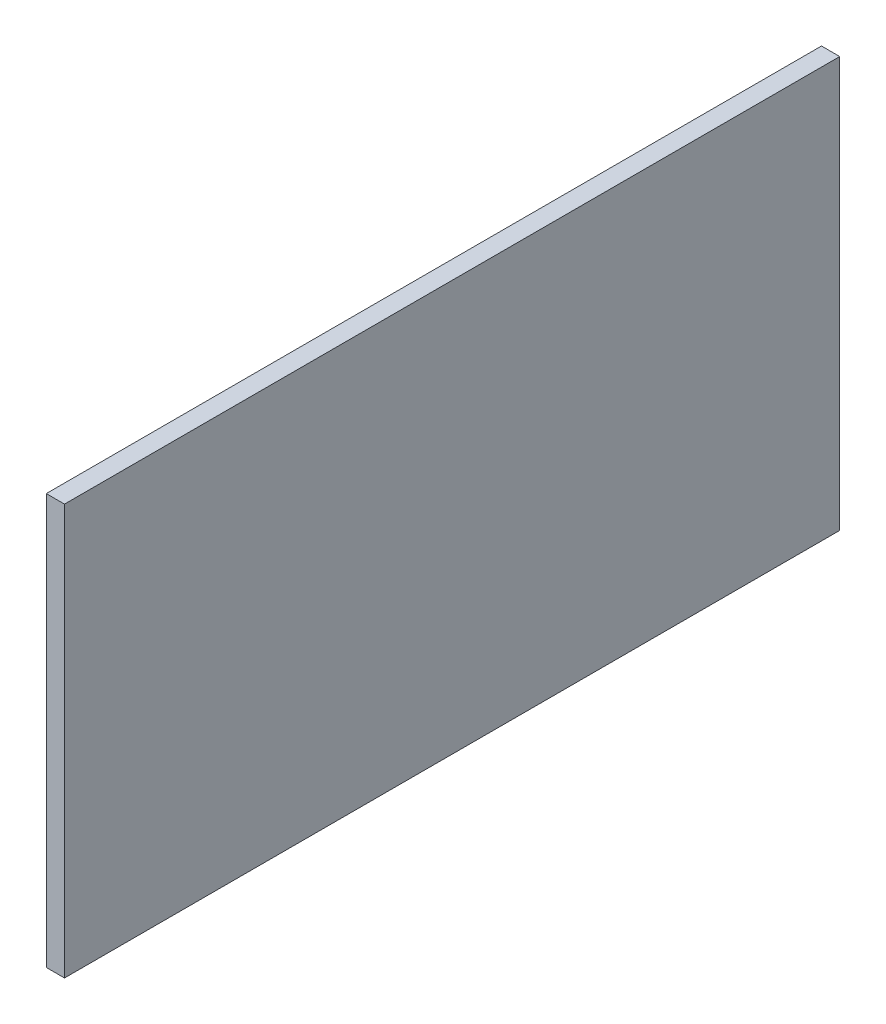
ISO-10303-21;
HEADER;
FILE_DESCRIPTION(('STEP AP214'),'2;1');
FILE_NAME('part.step','',(''),(''),'','','');
FILE_SCHEMA(('AUTOMOTIVE_DESIGN { 1 0 10303 214 1 1 1 1 }'));
ENDSEC;
DATA;
#1=APPLICATION_CONTEXT('core data for automotive mechanical design processes');
#2=APPLICATION_PROTOCOL_DEFINITION('international standard','automotive_design',2000,#1);
#3=PRODUCT_CONTEXT('',#1,'mechanical');
#4=PRODUCT('Part','Part','',(#3));
#5=PRODUCT_RELATED_PRODUCT_CATEGORY('part','',(#4));
#6=PRODUCT_DEFINITION_FORMATION('','',#4);
#7=PRODUCT_DEFINITION_CONTEXT('part definition',#1,'design');
#8=PRODUCT_DEFINITION('design','',#6,#7);
#9=PRODUCT_DEFINITION_SHAPE('','',#8);
#10=(LENGTH_UNIT() NAMED_UNIT(*) SI_UNIT(.MILLI.,.METRE.));
#11=(NAMED_UNIT(*) PLANE_ANGLE_UNIT() SI_UNIT($,.RADIAN.));
#12=(NAMED_UNIT(*) SI_UNIT($,.STERADIAN.) SOLID_ANGLE_UNIT());
#13=UNCERTAINTY_MEASURE_WITH_UNIT(LENGTH_MEASURE(1.E-05),#10,'distance_accuracy_value','');
#14=(GEOMETRIC_REPRESENTATION_CONTEXT(3) GLOBAL_UNCERTAINTY_ASSIGNED_CONTEXT((#13)) GLOBAL_UNIT_ASSIGNED_CONTEXT((#10,
#11,#12)) REPRESENTATION_CONTEXT('',''));
#15=CARTESIAN_POINT('',(0.,0.,0.));
#16=DIRECTION('',(0.,0.,1.));
#17=DIRECTION('',(1.,0.,0.));
#18=AXIS2_PLACEMENT_3D('',#15,#16,#17);
#19=CARTESIAN_POINT('',(2.,-22.5,-42.5));
#20=DIRECTION('',(0.,0.,1.));
#21=DIRECTION('',(1.,0.,0.));
#22=AXIS2_PLACEMENT_3D('',#19,#20,#21);
#23=PLANE('',#22);
#24=DIRECTION('',(0.,1.,0.));
#25=VECTOR('',#24,1.);
#26=CARTESIAN_POINT('',(0.,-22.5,-42.5));
#27=LINE('',#26,#25);
#28=CARTESIAN_POINT('',(0.,-22.5,-42.5));
#29=VERTEX_POINT('',#28);
#30=CARTESIAN_POINT('',(0.,22.5,-42.5));
#31=VERTEX_POINT('',#30);
#32=EDGE_CURVE('E101',#29,#31,#27,.T.);
#33=ORIENTED_EDGE('',*,*,#32,.T.);
#34=DIRECTION('',(-1.,0.,0.));
#35=VECTOR('',#34,1.);
#36=CARTESIAN_POINT('',(2.,22.5,-42.5));
#37=LINE('',#36,#35);
#38=CARTESIAN_POINT('',(2.,22.5,-42.5));
#39=VERTEX_POINT('',#38);
#40=EDGE_CURVE('E11',#39,#31,#37,.T.);
#41=ORIENTED_EDGE('',*,*,#40,.F.);
#42=DIRECTION('',(0.,1.,0.));
#43=VECTOR('',#42,1.);
#44=CARTESIAN_POINT('',(2.,-22.5,-42.5));
#45=LINE('',#44,#43);
#46=CARTESIAN_POINT('',(2.,-22.5,-42.5));
#47=VERTEX_POINT('',#46);
#48=EDGE_CURVE('E89',#47,#39,#45,.T.);
#49=ORIENTED_EDGE('',*,*,#48,.F.);
#50=DIRECTION('',(-1.,0.,0.));
#51=VECTOR('',#50,1.);
#52=CARTESIAN_POINT('',(2.,-22.5,-42.5));
#53=LINE('',#52,#51);
#54=EDGE_CURVE('E97',#47,#29,#53,.T.);
#55=ORIENTED_EDGE('',*,*,#54,.T.);
#56=EDGE_LOOP('',(#33,#41,#49,#55));
#57=FACE_BOUND('',#56,.T.);
#58=ADVANCED_FACE('F38',(#57),#23,.F.);
#59=CARTESIAN_POINT('',(2.,22.5,42.5));
#60=DIRECTION('',(0.,-1.,0.));
#61=DIRECTION('',(0.,0.,-1.));
#62=AXIS2_PLACEMENT_3D('',#59,#60,#61);
#63=PLANE('',#62);
#64=DIRECTION('',(0.,0.,1.));
#65=VECTOR('',#64,1.);
#66=CARTESIAN_POINT('',(0.,22.5,42.5));
#67=LINE('',#66,#65);
#68=CARTESIAN_POINT('',(0.,22.5,42.5));
#69=VERTEX_POINT('',#68);
#70=EDGE_CURVE('E93',#31,#69,#67,.T.);
#71=ORIENTED_EDGE('',*,*,#70,.T.);
#72=DIRECTION('',(-1.,0.,0.));
#73=VECTOR('',#72,1.);
#74=CARTESIAN_POINT('',(2.,22.5,42.5));
#75=LINE('',#74,#73);
#76=CARTESIAN_POINT('',(2.,22.5,42.5));
#77=VERTEX_POINT('',#76);
#78=EDGE_CURVE('E46',#77,#69,#75,.T.);
#79=ORIENTED_EDGE('',*,*,#78,.F.);
#80=DIRECTION('',(0.,0.,1.));
#81=VECTOR('',#80,1.);
#82=CARTESIAN_POINT('',(2.,22.5,42.5));
#83=LINE('',#82,#81);
#84=EDGE_CURVE('E84',#39,#77,#83,.T.);
#85=ORIENTED_EDGE('',*,*,#84,.F.);
#86=ORIENTED_EDGE('',*,*,#40,.T.);
#87=EDGE_LOOP('',(#71,#79,#85,#86));
#88=FACE_BOUND('',#87,.T.);
#89=ADVANCED_FACE('F92',(#88),#63,.F.);
#90=CARTESIAN_POINT('',(2.,-22.5,42.5));
#91=DIRECTION('',(0.,0.,-1.));
#92=DIRECTION('',(-1.,0.,0.));
#93=AXIS2_PLACEMENT_3D('',#90,#91,#92);
#94=PLANE('',#93);
#95=DIRECTION('',(0.,-1.,0.));
#96=VECTOR('',#95,1.);
#97=CARTESIAN_POINT('',(0.,-22.5,42.5));
#98=LINE('',#97,#96);
#99=CARTESIAN_POINT('',(0.,-22.5,42.5));
#100=VERTEX_POINT('',#99);
#101=EDGE_CURVE('E71',#69,#100,#98,.T.);
#102=ORIENTED_EDGE('',*,*,#101,.T.);
#103=DIRECTION('',(-1.,0.,0.));
#104=VECTOR('',#103,1.);
#105=CARTESIAN_POINT('',(2.,-22.5,42.5));
#106=LINE('',#105,#104);
#107=CARTESIAN_POINT('',(2.,-22.5,42.5));
#108=VERTEX_POINT('',#107);
#109=EDGE_CURVE('E94',#108,#100,#106,.T.);
#110=ORIENTED_EDGE('',*,*,#109,.F.);
#111=DIRECTION('',(0.,-1.,0.));
#112=VECTOR('',#111,1.);
#113=CARTESIAN_POINT('',(2.,-22.5,42.5));
#114=LINE('',#113,#112);
#115=EDGE_CURVE('E87',#77,#108,#114,.T.);
#116=ORIENTED_EDGE('',*,*,#115,.F.);
#117=ORIENTED_EDGE('',*,*,#78,.T.);
#118=EDGE_LOOP('',(#102,#110,#116,#117));
#119=FACE_BOUND('',#118,.T.);
#120=ADVANCED_FACE('F95',(#119),#94,.F.);
#121=CARTESIAN_POINT('',(2.,-22.5,42.5));
#122=DIRECTION('',(0.,1.,0.));
#123=DIRECTION('',(0.,0.,1.));
#124=AXIS2_PLACEMENT_3D('',#121,#122,#123);
#125=PLANE('',#124);
#126=DIRECTION('',(0.,0.,-1.));
#127=VECTOR('',#126,1.);
#128=CARTESIAN_POINT('',(0.,-22.5,42.5));
#129=LINE('',#128,#127);
#130=EDGE_CURVE('E77',#100,#29,#129,.T.);
#131=ORIENTED_EDGE('',*,*,#130,.T.);
#132=ORIENTED_EDGE('',*,*,#54,.F.);
#133=DIRECTION('',(0.,0.,-1.));
#134=VECTOR('',#133,1.);
#135=CARTESIAN_POINT('',(2.,-22.5,42.5));
#136=LINE('',#135,#134);
#137=EDGE_CURVE('E54',#108,#47,#136,.T.);
#138=ORIENTED_EDGE('',*,*,#137,.F.);
#139=ORIENTED_EDGE('',*,*,#109,.T.);
#140=EDGE_LOOP('',(#131,#132,#138,#139));
#141=FACE_BOUND('',#140,.T.);
#142=ADVANCED_FACE('F108',(#141),#125,.F.);
#143=CARTESIAN_POINT('',(2.,0.,0.));
#144=DIRECTION('',(-1.,0.,0.));
#145=DIRECTION('',(0.,0.,1.));
#146=AXIS2_PLACEMENT_3D('',#143,#144,#145);
#147=PLANE('',#146);
#148=ORIENTED_EDGE('',*,*,#48,.T.);
#149=ORIENTED_EDGE('',*,*,#84,.T.);
#150=ORIENTED_EDGE('',*,*,#115,.T.);
#151=ORIENTED_EDGE('',*,*,#137,.T.);
#152=EDGE_LOOP('',(#148,#149,#150,#151));
#153=FACE_BOUND('',#152,.T.);
#154=ADVANCED_FACE('F85',(#153),#147,.F.);
#155=CARTESIAN_POINT('',(0.,0.,0.));
#156=DIRECTION('',(-1.,0.,0.));
#157=DIRECTION('',(0.,0.,1.));
#158=AXIS2_PLACEMENT_3D('',#155,#156,#157);
#159=PLANE('',#158);
#160=ORIENTED_EDGE('',*,*,#32,.F.);
#161=ORIENTED_EDGE('',*,*,#130,.F.);
#162=ORIENTED_EDGE('',*,*,#101,.F.);
#163=ORIENTED_EDGE('',*,*,#70,.F.);
#164=EDGE_LOOP('',(#160,#161,#162,#163));
#165=FACE_BOUND('',#164,.T.);
#166=ADVANCED_FACE('F111',(#165),#159,.T.);
#167=CLOSED_SHELL('',(#58,#89,#120,#142,#154,#166));
#168=MANIFOLD_SOLID_BREP('B2',#167);
#169=ADVANCED_BREP_SHAPE_REPRESENTATION('',(#18,#168),#14);
#170=SHAPE_DEFINITION_REPRESENTATION(#9,#169);
ENDSEC;
END-ISO-10303-21;
